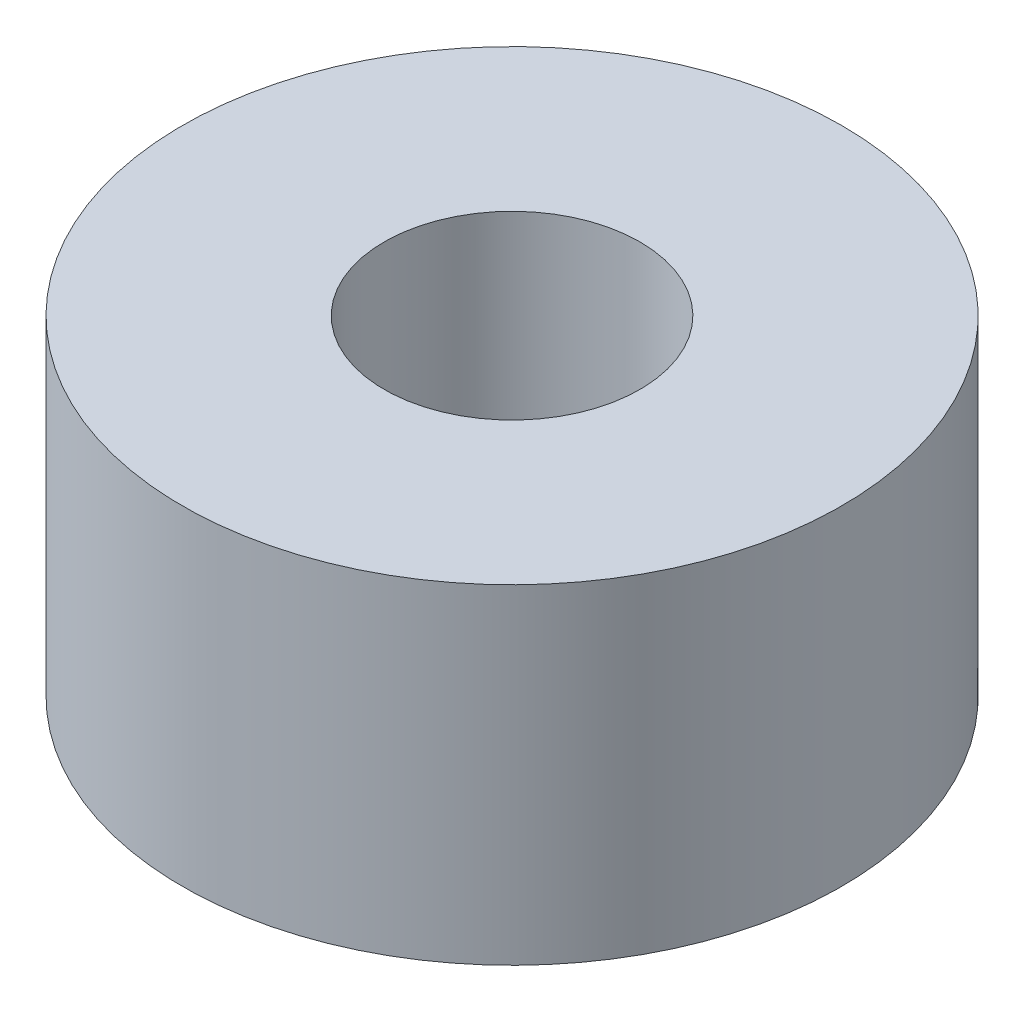
ISO-10303-21;
HEADER;
FILE_DESCRIPTION(('STEP AP214'),'2;1');
FILE_NAME('part.step','',(''),(''),'','','');
FILE_SCHEMA(('AUTOMOTIVE_DESIGN { 1 0 10303 214 1 1 1 1 }'));
ENDSEC;
DATA;
#1=APPLICATION_CONTEXT('core data for automotive mechanical design processes');
#2=APPLICATION_PROTOCOL_DEFINITION('international standard','automotive_design',2000,#1);
#3=PRODUCT_CONTEXT('',#1,'mechanical');
#4=PRODUCT('Part','Part','',(#3));
#5=PRODUCT_RELATED_PRODUCT_CATEGORY('part','',(#4));
#6=PRODUCT_DEFINITION_FORMATION('','',#4);
#7=PRODUCT_DEFINITION_CONTEXT('part definition',#1,'design');
#8=PRODUCT_DEFINITION('design','',#6,#7);
#9=PRODUCT_DEFINITION_SHAPE('','',#8);
#10=(LENGTH_UNIT() NAMED_UNIT(*) SI_UNIT(.MILLI.,.METRE.));
#11=(NAMED_UNIT(*) PLANE_ANGLE_UNIT() SI_UNIT($,.RADIAN.));
#12=(NAMED_UNIT(*) SI_UNIT($,.STERADIAN.) SOLID_ANGLE_UNIT());
#13=UNCERTAINTY_MEASURE_WITH_UNIT(LENGTH_MEASURE(1.E-05),#10,'distance_accuracy_value','');
#14=(GEOMETRIC_REPRESENTATION_CONTEXT(3) GLOBAL_UNCERTAINTY_ASSIGNED_CONTEXT((#13)) GLOBAL_UNIT_ASSIGNED_CONTEXT((#10,
#11,#12)) REPRESENTATION_CONTEXT('',''));
#15=CARTESIAN_POINT('',(0.,0.,0.));
#16=DIRECTION('',(0.,0.,1.));
#17=DIRECTION('',(1.,0.,0.));
#18=AXIS2_PLACEMENT_3D('',#15,#16,#17);
#19=CARTESIAN_POINT('',(0.,3.175,0.));
#20=DIRECTION('',(0.,-1.,0.));
#21=DIRECTION('',(0.,0.,-1.));
#22=AXIS2_PLACEMENT_3D('',#19,#20,#21);
#23=CYLINDRICAL_SURFACE('',#22,2.4638);
#24=CARTESIAN_POINT('',(0.,-3.175,0.));
#25=DIRECTION('',(0.,-1.,0.));
#26=DIRECTION('',(0.,0.,-1.));
#27=AXIS2_PLACEMENT_3D('',#24,#25,#26);
#28=CIRCLE('',#27,2.4638);
#29=CARTESIAN_POINT('',(0.,-3.175,-2.4638));
#30=VERTEX_POINT('',#29);
#31=EDGE_CURVE('E26',#30,#30,#28,.T.);
#32=ORIENTED_EDGE('',*,*,#31,.T.);
#33=EDGE_LOOP('',(#32));
#34=FACE_BOUND('',#33,.T.);
#35=CARTESIAN_POINT('',(0.,3.175,0.));
#36=DIRECTION('',(0.,-1.,0.));
#37=DIRECTION('',(0.,0.,-1.));
#38=AXIS2_PLACEMENT_3D('',#35,#36,#37);
#39=CIRCLE('',#38,2.4638);
#40=CARTESIAN_POINT('',(0.,3.175,-2.4638));
#41=VERTEX_POINT('',#40);
#42=EDGE_CURVE('E17',#41,#41,#39,.T.);
#43=ORIENTED_EDGE('',*,*,#42,.F.);
#44=EDGE_LOOP('',(#43));
#45=FACE_BOUND('',#44,.T.);
#46=ADVANCED_FACE('F14',(#34,#45),#23,.F.);
#47=CARTESIAN_POINT('',(0.,3.175,0.));
#48=DIRECTION('',(0.,1.,0.));
#49=DIRECTION('',(0.,0.,1.));
#50=AXIS2_PLACEMENT_3D('',#47,#48,#49);
#51=PLANE('',#50);
#52=ORIENTED_EDGE('',*,*,#42,.T.);
#53=EDGE_LOOP('',(#52));
#54=FACE_BOUND('',#53,.T.);
#55=CARTESIAN_POINT('',(0.,3.175,0.));
#56=DIRECTION('',(0.,-1.,0.));
#57=DIRECTION('',(0.,0.,-1.));
#58=AXIS2_PLACEMENT_3D('',#55,#56,#57);
#59=CIRCLE('',#58,6.35);
#60=CARTESIAN_POINT('',(0.,3.175,-6.35));
#61=VERTEX_POINT('',#60);
#62=EDGE_CURVE('E21',#61,#61,#59,.T.);
#63=ORIENTED_EDGE('',*,*,#62,.F.);
#64=EDGE_LOOP('',(#63));
#65=FACE_BOUND('',#64,.T.);
#66=ADVANCED_FACE('F34',(#54,#65),#51,.T.);
#67=CARTESIAN_POINT('',(0.,-3.175,0.));
#68=DIRECTION('',(0.,1.,0.));
#69=DIRECTION('',(0.,0.,1.));
#70=AXIS2_PLACEMENT_3D('',#67,#68,#69);
#71=PLANE('',#70);
#72=ORIENTED_EDGE('',*,*,#31,.F.);
#73=EDGE_LOOP('',(#72));
#74=FACE_BOUND('',#73,.T.);
#75=CARTESIAN_POINT('',(0.,-3.175,0.));
#76=DIRECTION('',(0.,-1.,0.));
#77=DIRECTION('',(0.,0.,-1.));
#78=AXIS2_PLACEMENT_3D('',#75,#76,#77);
#79=CIRCLE('',#78,6.35);
#80=CARTESIAN_POINT('',(0.,-3.175,-6.35));
#81=VERTEX_POINT('',#80);
#82=EDGE_CURVE('E9',#81,#81,#79,.F.);
#83=ORIENTED_EDGE('',*,*,#82,.F.);
#84=EDGE_LOOP('',(#83));
#85=FACE_BOUND('',#84,.T.);
#86=ADVANCED_FACE('F42',(#74,#85),#71,.F.);
#87=CARTESIAN_POINT('',(0.,3.175,0.));
#88=DIRECTION('',(0.,-1.,0.));
#89=DIRECTION('',(0.,0.,-1.));
#90=AXIS2_PLACEMENT_3D('',#87,#88,#89);
#91=CYLINDRICAL_SURFACE('',#90,6.35);
#92=ORIENTED_EDGE('',*,*,#62,.T.);
#93=EDGE_LOOP('',(#92));
#94=FACE_BOUND('',#93,.T.);
#95=ORIENTED_EDGE('',*,*,#82,.T.);
#96=EDGE_LOOP('',(#95));
#97=FACE_BOUND('',#96,.T.);
#98=ADVANCED_FACE('F43',(#94,#97),#91,.T.);
#99=CLOSED_SHELL('',(#46,#66,#86,#98));
#100=MANIFOLD_SOLID_BREP('B1',#99);
#101=ADVANCED_BREP_SHAPE_REPRESENTATION('',(#18,#100),#14);
#102=SHAPE_DEFINITION_REPRESENTATION(#9,#101);
ENDSEC;
END-ISO-10303-21;
